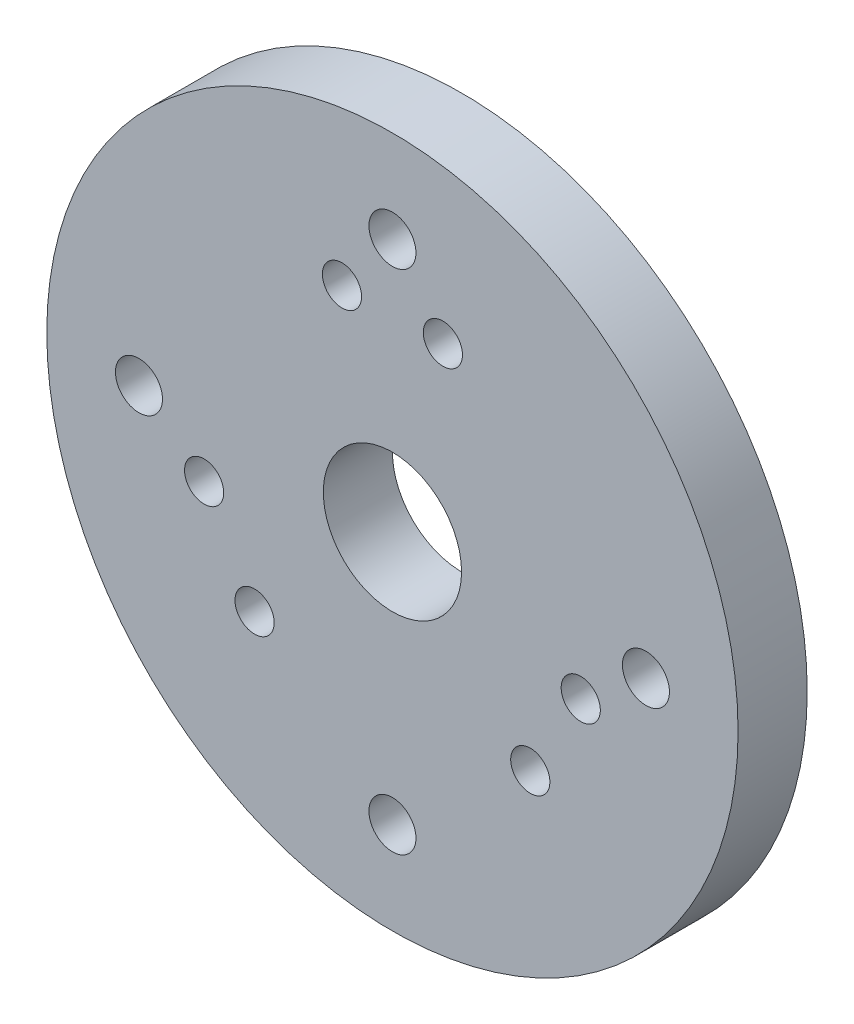
ISO-10303-21;
HEADER;
FILE_DESCRIPTION(('STEP AP214'),'2;1');
FILE_NAME('part.step','',(''),(''),'','','');
FILE_SCHEMA(('AUTOMOTIVE_DESIGN { 1 0 10303 214 1 1 1 1 }'));
ENDSEC;
DATA;
#1=APPLICATION_CONTEXT('core data for automotive mechanical design processes');
#2=APPLICATION_PROTOCOL_DEFINITION('international standard','automotive_design',2000,#1);
#3=PRODUCT_CONTEXT('',#1,'mechanical');
#4=PRODUCT('Part','Part','',(#3));
#5=PRODUCT_RELATED_PRODUCT_CATEGORY('part','',(#4));
#6=PRODUCT_DEFINITION_FORMATION('','',#4);
#7=PRODUCT_DEFINITION_CONTEXT('part definition',#1,'design');
#8=PRODUCT_DEFINITION('design','',#6,#7);
#9=PRODUCT_DEFINITION_SHAPE('','',#8);
#10=(LENGTH_UNIT() NAMED_UNIT(*) SI_UNIT(.MILLI.,.METRE.));
#11=(NAMED_UNIT(*) PLANE_ANGLE_UNIT() SI_UNIT($,.RADIAN.));
#12=(NAMED_UNIT(*) SI_UNIT($,.STERADIAN.) SOLID_ANGLE_UNIT());
#13=UNCERTAINTY_MEASURE_WITH_UNIT(LENGTH_MEASURE(1.E-05),#10,'distance_accuracy_value','');
#14=(GEOMETRIC_REPRESENTATION_CONTEXT(3) GLOBAL_UNCERTAINTY_ASSIGNED_CONTEXT((#13)) GLOBAL_UNIT_ASSIGNED_CONTEXT((#10,
#11,#12)) REPRESENTATION_CONTEXT('',''));
#15=CARTESIAN_POINT('',(0.,0.,0.));
#16=DIRECTION('',(0.,0.,1.));
#17=DIRECTION('',(1.,0.,0.));
#18=AXIS2_PLACEMENT_3D('',#15,#16,#17);
#19=CARTESIAN_POINT('',(0.,0.,7.5));
#20=DIRECTION('',(0.,0.,1.));
#21=DIRECTION('',(1.,0.,0.));
#22=AXIS2_PLACEMENT_3D('',#19,#20,#21);
#23=PLANE('',#22);
#24=CARTESIAN_POINT('',(-40.8586624520276,-10.9480456078367,7.5));
#25=DIRECTION('',(0.,0.,1.));
#26=DIRECTION('',(1.,0.,0.));
#27=AXIS2_PLACEMENT_3D('',#24,#25,#26);
#28=CIRCLE('',#27,4.25000000000001);
#29=CARTESIAN_POINT('',(-36.6086624520276,-10.9480456078367,7.5));
#30=VERTEX_POINT('',#29);
#31=EDGE_CURVE('E146',#30,#30,#28,.T.);
#32=ORIENTED_EDGE('',*,*,#31,.F.);
#33=EDGE_LOOP('',(#32));
#34=FACE_BOUND('',#33,.T.);
#35=CARTESIAN_POINT('',(-10.9480456078365,40.8586624520276,7.5));
#36=DIRECTION('',(0.,0.,1.));
#37=DIRECTION('',(-1.,0.,0.));
#38=AXIS2_PLACEMENT_3D('',#35,#36,#37);
#39=CIRCLE('',#38,4.25000000000001);
#40=CARTESIAN_POINT('',(-15.1980456078365,40.8586624520276,7.5));
#41=VERTEX_POINT('',#40);
#42=EDGE_CURVE('E128',#41,#41,#39,.T.);
#43=ORIENTED_EDGE('',*,*,#42,.F.);
#44=EDGE_LOOP('',(#43));
#45=FACE_BOUND('',#44,.T.);
#46=CARTESIAN_POINT('',(10.9480456078365,40.8586624520276,7.5));
#47=DIRECTION('',(0.,0.,1.));
#48=DIRECTION('',(1.,0.,0.));
#49=AXIS2_PLACEMENT_3D('',#46,#47,#48);
#50=CIRCLE('',#49,4.25000000000001);
#51=CARTESIAN_POINT('',(15.1980456078365,40.8586624520276,7.5));
#52=VERTEX_POINT('',#51);
#53=EDGE_CURVE('E111',#52,#52,#50,.T.);
#54=ORIENTED_EDGE('',*,*,#53,.F.);
#55=EDGE_LOOP('',(#54));
#56=FACE_BOUND('',#55,.T.);
#57=CARTESIAN_POINT('',(0.,-55.,7.5));
#58=DIRECTION('',(0.,0.,1.));
#59=DIRECTION('',(1.,0.,0.));
#60=AXIS2_PLACEMENT_3D('',#57,#58,#59);
#61=CIRCLE('',#60,5.1);
#62=CARTESIAN_POINT('',(5.09999999999997,-55.,7.5));
#63=VERTEX_POINT('',#62);
#64=EDGE_CURVE('E91',#63,#63,#61,.T.);
#65=ORIENTED_EDGE('',*,*,#64,.F.);
#66=EDGE_LOOP('',(#65));
#67=FACE_BOUND('',#66,.T.);
#68=CARTESIAN_POINT('',(0.,55.,7.5));
#69=DIRECTION('',(0.,0.,1.));
#70=DIRECTION('',(1.,0.,0.));
#71=AXIS2_PLACEMENT_3D('',#68,#69,#70);
#72=CIRCLE('',#71,5.1);
#73=CARTESIAN_POINT('',(5.09999999999997,55.,7.5));
#74=VERTEX_POINT('',#73);
#75=EDGE_CURVE('E69',#74,#74,#72,.T.);
#76=ORIENTED_EDGE('',*,*,#75,.F.);
#77=EDGE_LOOP('',(#76));
#78=FACE_BOUND('',#77,.T.);
#79=CARTESIAN_POINT('',(0.,0.,7.5));
#80=DIRECTION('',(0.,0.,1.));
#81=DIRECTION('',(1.,0.,0.));
#82=AXIS2_PLACEMENT_3D('',#79,#80,#81);
#83=CIRCLE('',#82,75.);
#84=CARTESIAN_POINT('',(75.,0.,7.5));
#85=VERTEX_POINT('',#84);
#86=EDGE_CURVE('E12',#85,#85,#83,.T.);
#87=ORIENTED_EDGE('',*,*,#86,.T.);
#88=EDGE_LOOP('',(#87));
#89=FACE_BOUND('',#88,.T.);
#90=CARTESIAN_POINT('',(0.,0.,7.5));
#91=DIRECTION('',(0.,0.,1.));
#92=DIRECTION('',(1.,0.,0.));
#93=AXIS2_PLACEMENT_3D('',#90,#91,#92);
#94=CIRCLE('',#93,15.);
#95=CARTESIAN_POINT('',(15.,0.,7.5));
#96=VERTEX_POINT('',#95);
#97=EDGE_CURVE('E62',#96,#96,#94,.T.);
#98=ORIENTED_EDGE('',*,*,#97,.F.);
#99=EDGE_LOOP('',(#98));
#100=FACE_BOUND('',#99,.T.);
#101=CARTESIAN_POINT('',(-55.,0.,7.5));
#102=DIRECTION('',(0.,0.,1.));
#103=DIRECTION('',(1.,0.,0.));
#104=AXIS2_PLACEMENT_3D('',#101,#102,#103);
#105=CIRCLE('',#104,5.1);
#106=CARTESIAN_POINT('',(-49.9,0.,7.5));
#107=VERTEX_POINT('',#106);
#108=EDGE_CURVE('E83',#107,#107,#105,.T.);
#109=ORIENTED_EDGE('',*,*,#108,.F.);
#110=EDGE_LOOP('',(#109));
#111=FACE_BOUND('',#110,.T.);
#112=CARTESIAN_POINT('',(55.,0.,7.5));
#113=DIRECTION('',(0.,0.,1.));
#114=DIRECTION('',(1.,0.,0.));
#115=AXIS2_PLACEMENT_3D('',#112,#113,#114);
#116=CIRCLE('',#115,5.1);
#117=CARTESIAN_POINT('',(60.1,0.,7.5));
#118=VERTEX_POINT('',#117);
#119=EDGE_CURVE('E100',#118,#118,#116,.T.);
#120=ORIENTED_EDGE('',*,*,#119,.F.);
#121=EDGE_LOOP('',(#120));
#122=FACE_BOUND('',#121,.T.);
#123=CARTESIAN_POINT('',(29.910616844191,-29.9106168441909,7.5));
#124=DIRECTION('',(0.,0.,1.));
#125=DIRECTION('',(1.,0.,0.));
#126=AXIS2_PLACEMENT_3D('',#123,#124,#125);
#127=CIRCLE('',#126,4.25000000000003);
#128=CARTESIAN_POINT('',(34.1606168441911,-29.9106168441909,7.5));
#129=VERTEX_POINT('',#128);
#130=EDGE_CURVE('E119',#129,#129,#127,.T.);
#131=ORIENTED_EDGE('',*,*,#130,.F.);
#132=EDGE_LOOP('',(#131));
#133=FACE_BOUND('',#132,.T.);
#134=CARTESIAN_POINT('',(40.8586624520275,-10.9480456078367,7.5));
#135=DIRECTION('',(0.,0.,1.));
#136=DIRECTION('',(-1.,0.,0.));
#137=AXIS2_PLACEMENT_3D('',#134,#135,#136);
#138=CIRCLE('',#137,4.25000000000001);
#139=CARTESIAN_POINT('',(36.6086624520275,-10.9480456078367,7.5));
#140=VERTEX_POINT('',#139);
#141=EDGE_CURVE('E138',#140,#140,#138,.T.);
#142=ORIENTED_EDGE('',*,*,#141,.F.);
#143=EDGE_LOOP('',(#142));
#144=FACE_BOUND('',#143,.T.);
#145=CARTESIAN_POINT('',(-29.910616844191,-29.9106168441909,7.5));
#146=DIRECTION('',(0.,0.,1.));
#147=DIRECTION('',(-1.,0.,0.));
#148=AXIS2_PLACEMENT_3D('',#145,#146,#147);
#149=CIRCLE('',#148,4.25000000000002);
#150=CARTESIAN_POINT('',(-34.160616844191,-29.9106168441909,7.5));
#151=VERTEX_POINT('',#150);
#152=EDGE_CURVE('E155',#151,#151,#149,.T.);
#153=ORIENTED_EDGE('',*,*,#152,.F.);
#154=EDGE_LOOP('',(#153));
#155=FACE_BOUND('',#154,.T.);
#156=ADVANCED_FACE('F46',(#34,#45,#56,#67,#78,#89,#100,#111,#122,#133,#144,#155),#23,.T.);
#157=CARTESIAN_POINT('',(0.,0.,-7.5));
#158=DIRECTION('',(0.,0.,1.));
#159=DIRECTION('',(1.,0.,0.));
#160=AXIS2_PLACEMENT_3D('',#157,#158,#159);
#161=PLANE('',#160);
#162=CARTESIAN_POINT('',(0.,0.,-7.5));
#163=DIRECTION('',(0.,0.,1.));
#164=DIRECTION('',(1.,0.,0.));
#165=AXIS2_PLACEMENT_3D('',#162,#163,#164);
#166=CIRCLE('',#165,75.);
#167=CARTESIAN_POINT('',(75.,0.,-7.5));
#168=VERTEX_POINT('',#167);
#169=EDGE_CURVE('E50',#168,#168,#166,.T.);
#170=ORIENTED_EDGE('',*,*,#169,.F.);
#171=EDGE_LOOP('',(#170));
#172=FACE_BOUND('',#171,.T.);
#173=CARTESIAN_POINT('',(0.,0.,-7.5));
#174=DIRECTION('',(0.,0.,1.));
#175=DIRECTION('',(1.,0.,0.));
#176=AXIS2_PLACEMENT_3D('',#173,#174,#175);
#177=CIRCLE('',#176,15.);
#178=CARTESIAN_POINT('',(15.,0.,-7.5));
#179=VERTEX_POINT('',#178);
#180=EDGE_CURVE('E64',#179,#179,#177,.T.);
#181=ORIENTED_EDGE('',*,*,#180,.T.);
#182=EDGE_LOOP('',(#181));
#183=FACE_BOUND('',#182,.T.);
#184=CARTESIAN_POINT('',(0.,55.,-7.5));
#185=DIRECTION('',(0.,0.,1.));
#186=DIRECTION('',(1.,0.,0.));
#187=AXIS2_PLACEMENT_3D('',#184,#185,#186);
#188=CIRCLE('',#187,5.1);
#189=CARTESIAN_POINT('',(5.09999999999997,55.,-7.5));
#190=VERTEX_POINT('',#189);
#191=EDGE_CURVE('E78',#190,#190,#188,.T.);
#192=ORIENTED_EDGE('',*,*,#191,.T.);
#193=EDGE_LOOP('',(#192));
#194=FACE_BOUND('',#193,.T.);
#195=CARTESIAN_POINT('',(-55.,0.,-7.5));
#196=DIRECTION('',(0.,0.,1.));
#197=DIRECTION('',(1.,0.,0.));
#198=AXIS2_PLACEMENT_3D('',#195,#196,#197);
#199=CIRCLE('',#198,5.1);
#200=CARTESIAN_POINT('',(-49.9,0.,-7.5));
#201=VERTEX_POINT('',#200);
#202=EDGE_CURVE('E86',#201,#201,#199,.T.);
#203=ORIENTED_EDGE('',*,*,#202,.T.);
#204=EDGE_LOOP('',(#203));
#205=FACE_BOUND('',#204,.T.);
#206=CARTESIAN_POINT('',(0.,-55.,-7.5));
#207=DIRECTION('',(0.,0.,1.));
#208=DIRECTION('',(1.,0.,0.));
#209=AXIS2_PLACEMENT_3D('',#206,#207,#208);
#210=CIRCLE('',#209,5.1);
#211=CARTESIAN_POINT('',(5.09999999999997,-55.,-7.5));
#212=VERTEX_POINT('',#211);
#213=EDGE_CURVE('E95',#212,#212,#210,.T.);
#214=ORIENTED_EDGE('',*,*,#213,.T.);
#215=EDGE_LOOP('',(#214));
#216=FACE_BOUND('',#215,.T.);
#217=CARTESIAN_POINT('',(55.,0.,-7.5));
#218=DIRECTION('',(0.,0.,1.));
#219=DIRECTION('',(1.,0.,0.));
#220=AXIS2_PLACEMENT_3D('',#217,#218,#219);
#221=CIRCLE('',#220,5.1);
#222=CARTESIAN_POINT('',(60.1,0.,-7.5));
#223=VERTEX_POINT('',#222);
#224=EDGE_CURVE('E106',#223,#223,#221,.T.);
#225=ORIENTED_EDGE('',*,*,#224,.T.);
#226=EDGE_LOOP('',(#225));
#227=FACE_BOUND('',#226,.T.);
#228=CARTESIAN_POINT('',(10.9480456078365,40.8586624520276,-7.5));
#229=DIRECTION('',(0.,0.,1.));
#230=DIRECTION('',(1.,0.,0.));
#231=AXIS2_PLACEMENT_3D('',#228,#229,#230);
#232=CIRCLE('',#231,4.25000000000001);
#233=CARTESIAN_POINT('',(15.1980456078365,40.8586624520276,-7.5));
#234=VERTEX_POINT('',#233);
#235=EDGE_CURVE('E114',#234,#234,#232,.T.);
#236=ORIENTED_EDGE('',*,*,#235,.T.);
#237=EDGE_LOOP('',(#236));
#238=FACE_BOUND('',#237,.T.);
#239=CARTESIAN_POINT('',(29.910616844191,-29.9106168441909,-7.5));
#240=DIRECTION('',(0.,0.,1.));
#241=DIRECTION('',(1.,0.,0.));
#242=AXIS2_PLACEMENT_3D('',#239,#240,#241);
#243=CIRCLE('',#242,4.25000000000003);
#244=CARTESIAN_POINT('',(34.1606168441911,-29.9106168441909,-7.5));
#245=VERTEX_POINT('',#244);
#246=EDGE_CURVE('E123',#245,#245,#243,.T.);
#247=ORIENTED_EDGE('',*,*,#246,.T.);
#248=EDGE_LOOP('',(#247));
#249=FACE_BOUND('',#248,.T.);
#250=CARTESIAN_POINT('',(-10.9480456078365,40.8586624520276,-7.5));
#251=DIRECTION('',(0.,0.,1.));
#252=DIRECTION('',(-1.,0.,0.));
#253=AXIS2_PLACEMENT_3D('',#250,#251,#252);
#254=CIRCLE('',#253,4.25000000000001);
#255=CARTESIAN_POINT('',(-15.1980456078365,40.8586624520276,-7.5));
#256=VERTEX_POINT('',#255);
#257=EDGE_CURVE('E133',#256,#256,#254,.T.);
#258=ORIENTED_EDGE('',*,*,#257,.T.);
#259=EDGE_LOOP('',(#258));
#260=FACE_BOUND('',#259,.T.);
#261=CARTESIAN_POINT('',(40.8586624520275,-10.9480456078367,-7.5));
#262=DIRECTION('',(0.,0.,1.));
#263=DIRECTION('',(-1.,0.,0.));
#264=AXIS2_PLACEMENT_3D('',#261,#262,#263);
#265=CIRCLE('',#264,4.25000000000001);
#266=CARTESIAN_POINT('',(36.6086624520275,-10.9480456078367,-7.5));
#267=VERTEX_POINT('',#266);
#268=EDGE_CURVE('E141',#267,#267,#265,.T.);
#269=ORIENTED_EDGE('',*,*,#268,.T.);
#270=EDGE_LOOP('',(#269));
#271=FACE_BOUND('',#270,.T.);
#272=CARTESIAN_POINT('',(-40.8586624520276,-10.9480456078367,-7.5));
#273=DIRECTION('',(0.,0.,1.));
#274=DIRECTION('',(1.,0.,0.));
#275=AXIS2_PLACEMENT_3D('',#272,#273,#274);
#276=CIRCLE('',#275,4.25000000000001);
#277=CARTESIAN_POINT('',(-36.6086624520276,-10.9480456078367,-7.5));
#278=VERTEX_POINT('',#277);
#279=EDGE_CURVE('E150',#278,#278,#276,.T.);
#280=ORIENTED_EDGE('',*,*,#279,.T.);
#281=EDGE_LOOP('',(#280));
#282=FACE_BOUND('',#281,.T.);
#283=CARTESIAN_POINT('',(-29.910616844191,-29.9106168441909,-7.5));
#284=DIRECTION('',(0.,0.,1.));
#285=DIRECTION('',(-1.,0.,0.));
#286=AXIS2_PLACEMENT_3D('',#283,#284,#285);
#287=CIRCLE('',#286,4.25000000000002);
#288=CARTESIAN_POINT('',(-34.160616844191,-29.9106168441909,-7.5));
#289=VERTEX_POINT('',#288);
#290=EDGE_CURVE('E158',#289,#289,#287,.T.);
#291=ORIENTED_EDGE('',*,*,#290,.T.);
#292=EDGE_LOOP('',(#291));
#293=FACE_BOUND('',#292,.T.);
#294=ADVANCED_FACE('F174',(#172,#183,#194,#205,#216,#227,#238,#249,#260,#271,#282,#293),#161,.F.);
#295=CARTESIAN_POINT('',(0.,0.,7.5));
#296=DIRECTION('',(0.,0.,-1.));
#297=DIRECTION('',(-1.,0.,0.));
#298=AXIS2_PLACEMENT_3D('',#295,#296,#297);
#299=CYLINDRICAL_SURFACE('',#298,75.);
#300=ORIENTED_EDGE('',*,*,#86,.F.);
#301=EDGE_LOOP('',(#300));
#302=FACE_BOUND('',#301,.T.);
#303=ORIENTED_EDGE('',*,*,#169,.T.);
#304=EDGE_LOOP('',(#303));
#305=FACE_BOUND('',#304,.T.);
#306=ADVANCED_FACE('F48',(#302,#305),#299,.T.);
#307=CARTESIAN_POINT('',(0.,0.,7.5));
#308=DIRECTION('',(0.,0.,-1.));
#309=DIRECTION('',(-1.,0.,0.));
#310=AXIS2_PLACEMENT_3D('',#307,#308,#309);
#311=CYLINDRICAL_SURFACE('',#310,15.);
#312=ORIENTED_EDGE('',*,*,#97,.T.);
#313=EDGE_LOOP('',(#312));
#314=FACE_BOUND('',#313,.T.);
#315=ORIENTED_EDGE('',*,*,#180,.F.);
#316=EDGE_LOOP('',(#315));
#317=FACE_BOUND('',#316,.T.);
#318=ADVANCED_FACE('F184',(#314,#317),#311,.F.);
#319=CARTESIAN_POINT('',(0.,55.,7.5));
#320=DIRECTION('',(0.,0.,-1.));
#321=DIRECTION('',(-1.,0.,0.));
#322=AXIS2_PLACEMENT_3D('',#319,#320,#321);
#323=CYLINDRICAL_SURFACE('',#322,5.1);
#324=ORIENTED_EDGE('',*,*,#75,.T.);
#325=EDGE_LOOP('',(#324));
#326=FACE_BOUND('',#325,.T.);
#327=ORIENTED_EDGE('',*,*,#191,.F.);
#328=EDGE_LOOP('',(#327));
#329=FACE_BOUND('',#328,.T.);
#330=ADVANCED_FACE('F187',(#326,#329),#323,.F.);
#331=CARTESIAN_POINT('',(-55.,0.,7.5));
#332=DIRECTION('',(0.,0.,-1.));
#333=DIRECTION('',(-1.,0.,0.));
#334=AXIS2_PLACEMENT_3D('',#331,#332,#333);
#335=CYLINDRICAL_SURFACE('',#334,5.1);
#336=ORIENTED_EDGE('',*,*,#108,.T.);
#337=EDGE_LOOP('',(#336));
#338=FACE_BOUND('',#337,.T.);
#339=ORIENTED_EDGE('',*,*,#202,.F.);
#340=EDGE_LOOP('',(#339));
#341=FACE_BOUND('',#340,.T.);
#342=ADVANCED_FACE('F191',(#338,#341),#335,.F.);
#343=CARTESIAN_POINT('',(0.,-55.,7.5));
#344=DIRECTION('',(0.,0.,-1.));
#345=DIRECTION('',(-1.,0.,0.));
#346=AXIS2_PLACEMENT_3D('',#343,#344,#345);
#347=CYLINDRICAL_SURFACE('',#346,5.1);
#348=ORIENTED_EDGE('',*,*,#64,.T.);
#349=EDGE_LOOP('',(#348));
#350=FACE_BOUND('',#349,.T.);
#351=ORIENTED_EDGE('',*,*,#213,.F.);
#352=EDGE_LOOP('',(#351));
#353=FACE_BOUND('',#352,.T.);
#354=ADVANCED_FACE('F195',(#350,#353),#347,.F.);
#355=CARTESIAN_POINT('',(55.,0.,7.5));
#356=DIRECTION('',(0.,0.,-1.));
#357=DIRECTION('',(-1.,0.,0.));
#358=AXIS2_PLACEMENT_3D('',#355,#356,#357);
#359=CYLINDRICAL_SURFACE('',#358,5.1);
#360=ORIENTED_EDGE('',*,*,#119,.T.);
#361=EDGE_LOOP('',(#360));
#362=FACE_BOUND('',#361,.T.);
#363=ORIENTED_EDGE('',*,*,#224,.F.);
#364=EDGE_LOOP('',(#363));
#365=FACE_BOUND('',#364,.T.);
#366=ADVANCED_FACE('F199',(#362,#365),#359,.F.);
#367=CARTESIAN_POINT('',(10.9480456078365,40.8586624520276,7.5));
#368=DIRECTION('',(0.,0.,-1.));
#369=DIRECTION('',(-1.,0.,0.));
#370=AXIS2_PLACEMENT_3D('',#367,#368,#369);
#371=CYLINDRICAL_SURFACE('',#370,4.25000000000001);
#372=ORIENTED_EDGE('',*,*,#53,.T.);
#373=EDGE_LOOP('',(#372));
#374=FACE_BOUND('',#373,.T.);
#375=ORIENTED_EDGE('',*,*,#235,.F.);
#376=EDGE_LOOP('',(#375));
#377=FACE_BOUND('',#376,.T.);
#378=ADVANCED_FACE('F203',(#374,#377),#371,.F.);
#379=CARTESIAN_POINT('',(29.910616844191,-29.9106168441909,7.5));
#380=DIRECTION('',(0.,0.,-1.));
#381=DIRECTION('',(-1.,0.,0.));
#382=AXIS2_PLACEMENT_3D('',#379,#380,#381);
#383=CYLINDRICAL_SURFACE('',#382,4.25000000000003);
#384=ORIENTED_EDGE('',*,*,#130,.T.);
#385=EDGE_LOOP('',(#384));
#386=FACE_BOUND('',#385,.T.);
#387=ORIENTED_EDGE('',*,*,#246,.F.);
#388=EDGE_LOOP('',(#387));
#389=FACE_BOUND('',#388,.T.);
#390=ADVANCED_FACE('F207',(#386,#389),#383,.F.);
#391=CARTESIAN_POINT('',(-10.9480456078365,40.8586624520276,7.5));
#392=DIRECTION('',(0.,0.,-1.));
#393=DIRECTION('',(-1.,0.,0.));
#394=AXIS2_PLACEMENT_3D('',#391,#392,#393);
#395=CYLINDRICAL_SURFACE('',#394,4.25000000000001);
#396=ORIENTED_EDGE('',*,*,#42,.T.);
#397=EDGE_LOOP('',(#396));
#398=FACE_BOUND('',#397,.T.);
#399=ORIENTED_EDGE('',*,*,#257,.F.);
#400=EDGE_LOOP('',(#399));
#401=FACE_BOUND('',#400,.T.);
#402=ADVANCED_FACE('F211',(#398,#401),#395,.F.);
#403=CARTESIAN_POINT('',(40.8586624520275,-10.9480456078367,7.5));
#404=DIRECTION('',(0.,0.,-1.));
#405=DIRECTION('',(-1.,0.,0.));
#406=AXIS2_PLACEMENT_3D('',#403,#404,#405);
#407=CYLINDRICAL_SURFACE('',#406,4.25000000000001);
#408=ORIENTED_EDGE('',*,*,#141,.T.);
#409=EDGE_LOOP('',(#408));
#410=FACE_BOUND('',#409,.T.);
#411=ORIENTED_EDGE('',*,*,#268,.F.);
#412=EDGE_LOOP('',(#411));
#413=FACE_BOUND('',#412,.T.);
#414=ADVANCED_FACE('F215',(#410,#413),#407,.F.);
#415=CARTESIAN_POINT('',(-40.8586624520276,-10.9480456078367,7.5));
#416=DIRECTION('',(0.,0.,-1.));
#417=DIRECTION('',(-1.,0.,0.));
#418=AXIS2_PLACEMENT_3D('',#415,#416,#417);
#419=CYLINDRICAL_SURFACE('',#418,4.25000000000001);
#420=ORIENTED_EDGE('',*,*,#31,.T.);
#421=EDGE_LOOP('',(#420));
#422=FACE_BOUND('',#421,.T.);
#423=ORIENTED_EDGE('',*,*,#279,.F.);
#424=EDGE_LOOP('',(#423));
#425=FACE_BOUND('',#424,.T.);
#426=ADVANCED_FACE('F219',(#422,#425),#419,.F.);
#427=CARTESIAN_POINT('',(-29.910616844191,-29.9106168441909,7.5));
#428=DIRECTION('',(0.,0.,-1.));
#429=DIRECTION('',(-1.,0.,0.));
#430=AXIS2_PLACEMENT_3D('',#427,#428,#429);
#431=CYLINDRICAL_SURFACE('',#430,4.25000000000002);
#432=ORIENTED_EDGE('',*,*,#152,.T.);
#433=EDGE_LOOP('',(#432));
#434=FACE_BOUND('',#433,.T.);
#435=ORIENTED_EDGE('',*,*,#290,.F.);
#436=EDGE_LOOP('',(#435));
#437=FACE_BOUND('',#436,.T.);
#438=ADVANCED_FACE('F170',(#434,#437),#431,.F.);
#439=CLOSED_SHELL('',(#156,#294,#306,#318,#330,#342,#354,#366,#378,#390,#402,#414,#426,#438));
#440=MANIFOLD_SOLID_BREP('B2',#439);
#441=ADVANCED_BREP_SHAPE_REPRESENTATION('',(#18,#440),#14);
#442=SHAPE_DEFINITION_REPRESENTATION(#9,#441);
ENDSEC;
END-ISO-10303-21;
